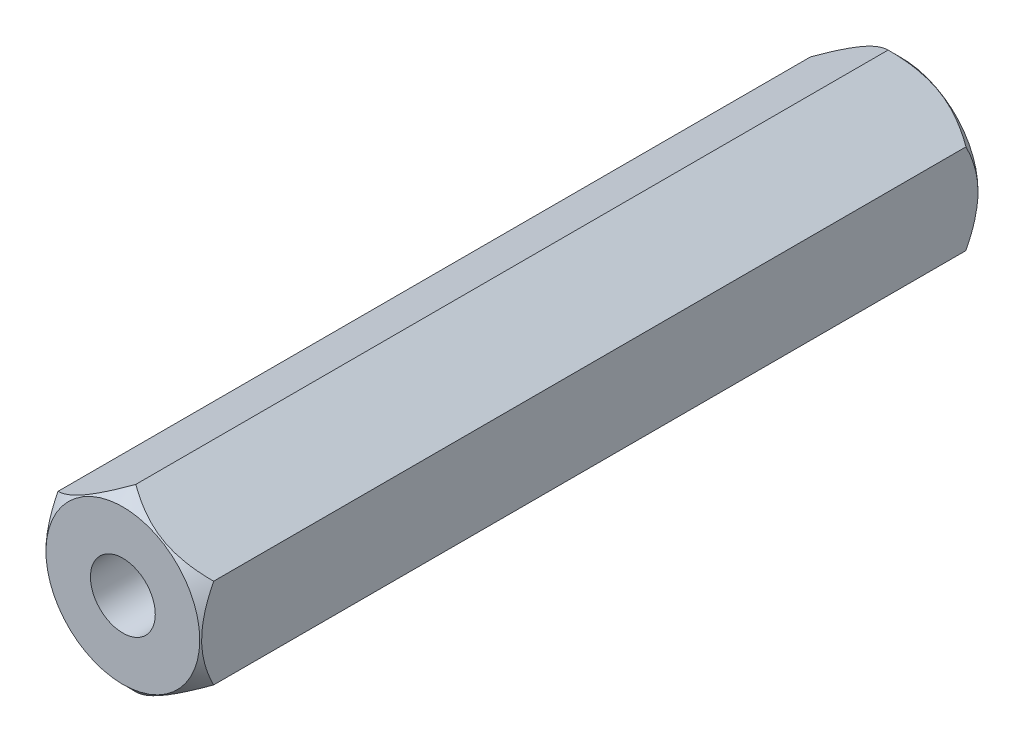
ISO-10303-21;
HEADER;
FILE_DESCRIPTION(('STEP AP214'),'2;1');
FILE_NAME('part.step','',(''),(''),'','','');
FILE_SCHEMA(('AUTOMOTIVE_DESIGN { 1 0 10303 214 1 1 1 1 }'));
ENDSEC;
DATA;
#1=APPLICATION_CONTEXT('core data for automotive mechanical design processes');
#2=APPLICATION_PROTOCOL_DEFINITION('international standard','automotive_design',2000,#1);
#3=PRODUCT_CONTEXT('',#1,'mechanical');
#4=PRODUCT('Part','Part','',(#3));
#5=PRODUCT_RELATED_PRODUCT_CATEGORY('part','',(#4));
#6=PRODUCT_DEFINITION_FORMATION('','',#4);
#7=PRODUCT_DEFINITION_CONTEXT('part definition',#1,'design');
#8=PRODUCT_DEFINITION('design','',#6,#7);
#9=PRODUCT_DEFINITION_SHAPE('','',#8);
#10=(LENGTH_UNIT() NAMED_UNIT(*) SI_UNIT(.MILLI.,.METRE.));
#11=(NAMED_UNIT(*) PLANE_ANGLE_UNIT() SI_UNIT($,.RADIAN.));
#12=(NAMED_UNIT(*) SI_UNIT($,.STERADIAN.) SOLID_ANGLE_UNIT());
#13=UNCERTAINTY_MEASURE_WITH_UNIT(LENGTH_MEASURE(1.E-05),#10,'distance_accuracy_value','');
#14=(GEOMETRIC_REPRESENTATION_CONTEXT(3) GLOBAL_UNCERTAINTY_ASSIGNED_CONTEXT((#13)) GLOBAL_UNIT_ASSIGNED_CONTEXT((#10,
#11,#12)) REPRESENTATION_CONTEXT('',''));
#15=CARTESIAN_POINT('',(0.,0.,0.));
#16=DIRECTION('',(0.,0.,1.));
#17=DIRECTION('',(1.,0.,0.));
#18=AXIS2_PLACEMENT_3D('',#15,#16,#17);
#19=CARTESIAN_POINT('',(2.99999999999998,1.73205080756891,15.));
#20=DIRECTION('',(-0.499999999999995,-0.866025403784441,0.));
#21=DIRECTION('',(0.866025403784442,-0.499999999999995,0.));
#22=AXIS2_PLACEMENT_3D('',#19,#20,#21);
#23=PLANE('',#22);
#24=CARTESIAN_POINT('',(3.00019999999998,1.73193533751508,14.4998845241729));
#25=CARTESIAN_POINT('',(2.89707648504423,1.79147372663456,14.5593716816782));
#26=CARTESIAN_POINT('',(2.79222861066933,1.85200767512887,14.6153650205345));
#27=CARTESIAN_POINT('',(2.57843232821888,1.97544301635337,14.7178874036211));
#28=CARTESIAN_POINT('',(2.46946358862022,2.03835614749391,14.7643594062587));
#29=CARTESIAN_POINT('',(2.24973336040295,2.16521745390425,14.8439668114837));
#30=CARTESIAN_POINT('',(2.13902782823776,2.2291333227006,14.8773022993573));
#31=CARTESIAN_POINT('',(1.91517958943465,2.3583721636312,14.9286624560207));
#32=CARTESIAN_POINT('',(1.80204372079298,2.42369118784647,14.9467254624644));
#33=CARTESIAN_POINT('',(1.60705904380727,2.53626564359202,14.9630230915495));
#34=CARTESIAN_POINT('',(1.52546204599784,2.58337569224236,14.9654356328262));
#35=CARTESIAN_POINT('',(1.36240077116988,2.67751916315868,14.9613705653429));
#36=CARTESIAN_POINT('',(1.28093655070098,2.72455255277573,14.9548898399717));
#37=CARTESIAN_POINT('',(1.11877988766159,2.81817374583241,14.9334082774848));
#38=CARTESIAN_POINT('',(1.03808841121566,2.86476099147977,14.9183979100327));
#39=CARTESIAN_POINT('',(0.87809130210862,2.95713536549228,14.880676353934));
#40=CARTESIAN_POINT('',(0.798785563690657,3.00292255491618,14.8579657556771));
#41=CARTESIAN_POINT('',(0.657993859197203,3.08420868340514,14.811239315146));
#42=CARTESIAN_POINT('',(0.596196277853935,3.11988753362894,14.7884516723192));
#43=CARTESIAN_POINT('',(0.473710582479749,3.1906046828251,14.7392037139425));
#44=CARTESIAN_POINT('',(0.41302250236437,3.22564296221632,14.7127432863338));
#45=CARTESIAN_POINT('',(0.292947002609118,3.29496858432309,14.6567430056086));
#46=CARTESIAN_POINT('',(0.233556167704067,3.32925789884292,14.6272128355216));
#47=CARTESIAN_POINT('',(0.115874438532723,3.39720147685869,14.5654609084245));
#48=CARTESIAN_POINT('',(0.0575828957522616,3.43085611477447,14.5332408033406));
#49=CARTESIAN_POINT('',(-0.000200000000000063,3.46421708519159,14.4998845241729));
#50=B_SPLINE_CURVE_WITH_KNOTS('',3,(#24,#25,#26,#27,#28,#29,#30,#31,#32,#33,#34,#35,#36,#37,#38,
#39,#40,#41,#42,#43,#44,#45,#46,#47,#48,#49),.UNSPECIFIED.,.F.,.F.,(4,2,2,2,2,2,2,2,2,2,2,2,4),
(0.,0.399603557139306,0.801535286397845,1.19708369162343,1.59163620080173,1.87398941755845,
2.15644160919094,2.43921001247427,2.7219567403214,2.94657516661927,3.17120044767273,
3.39513752837807,3.61893808380735),.UNSPECIFIED.);
#51=CARTESIAN_POINT('',(2.99999999999998,1.73205080756891,14.5));
#52=VERTEX_POINT('',#51);
#53=CARTESIAN_POINT('',(0.,3.46410161513776,14.5));
#54=VERTEX_POINT('',#53);
#55=EDGE_CURVE('E85',#52,#54,#50,.T.);
#56=ORIENTED_EDGE('',*,*,#55,.F.);
#57=DIRECTION('',(0.,0.,-1.));
#58=VECTOR('',#57,1.);
#59=CARTESIAN_POINT('',(2.99999999999998,1.73205080756891,15.));
#60=LINE('',#59,#58);
#61=CARTESIAN_POINT('',(2.99999999999998,1.73205080756891,-14.5));
#62=VERTEX_POINT('',#61);
#63=EDGE_CURVE('E55',#52,#62,#60,.T.);
#64=ORIENTED_EDGE('',*,*,#63,.T.);
#65=CARTESIAN_POINT('',(-0.0002,3.46421708519159,-14.4998845241729));
#66=CARTESIAN_POINT('',(0.102923514955747,3.40467869607211,-14.5593716816782));
#67=CARTESIAN_POINT('',(0.207771389330649,3.34414474757781,-14.6153650205345));
#68=CARTESIAN_POINT('',(0.421567671781093,3.2207094063533,-14.7178874036211));
#69=CARTESIAN_POINT('',(0.530536411379756,3.15779627521276,-14.7643594062587));
#70=CARTESIAN_POINT('',(0.750266639597023,3.03093496880243,-14.8439668114837));
#71=CARTESIAN_POINT('',(0.860972171762205,2.96701910000608,-14.8773022993573));
#72=CARTESIAN_POINT('',(1.08482041056532,2.83778025907548,-14.9286624560207));
#73=CARTESIAN_POINT('',(1.19795627920698,2.77246123486021,-14.9467254624644));
#74=CARTESIAN_POINT('',(1.39294095619269,2.65988677911466,-14.9630230915495));
#75=CARTESIAN_POINT('',(1.47453795400212,2.61277673046432,-14.9654356328262));
#76=CARTESIAN_POINT('',(1.63759922883008,2.518633259548,-14.9613705653429));
#77=CARTESIAN_POINT('',(1.71906344929898,2.47159986993096,-14.9548898399717));
#78=CARTESIAN_POINT('',(1.88122011233836,2.37797867687428,-14.9334082774848));
#79=CARTESIAN_POINT('',(1.96191158878429,2.33139143122691,-14.9183979100327));
#80=CARTESIAN_POINT('',(2.12190869789133,2.23901705721441,-14.880676353934));
#81=CARTESIAN_POINT('',(2.20121443630929,2.19322986779052,-14.8579657556772));
#82=CARTESIAN_POINT('',(2.34200614080274,2.11194373930155,-14.8112393151461));
#83=CARTESIAN_POINT('',(2.40380372214602,2.07626488907775,-14.7884516723192));
#84=CARTESIAN_POINT('',(2.52628941752021,2.00554773988158,-14.7392037139426));
#85=CARTESIAN_POINT('',(2.58697749763559,1.97050946049036,-14.7127432863338));
#86=CARTESIAN_POINT('',(2.70705299739085,1.90118383838359,-14.6567430056086));
#87=CARTESIAN_POINT('',(2.7664438322959,1.86689452386376,-14.6272128355216));
#88=CARTESIAN_POINT('',(2.88412556146725,1.79895094584798,-14.5654609084245));
#89=CARTESIAN_POINT('',(2.94241710424772,1.7652963079322,-14.5332408033406));
#90=CARTESIAN_POINT('',(3.00019999999998,1.73193533751508,-14.4998845241729));
#91=B_SPLINE_CURVE_WITH_KNOTS('',3,(#65,#66,#67,#68,#69,#70,#71,#72,#73,#74,#75,#76,#77,#78,#79,
#80,#81,#82,#83,#84,#85,#86,#87,#88,#89,#90),.UNSPECIFIED.,.F.,.F.,(4,2,2,2,2,2,2,2,2,2,2,2,4),
(0.,0.399603557139302,0.801535286397835,1.19708369162341,1.59163620080171,1.87398941755842,
2.15644160919091,2.43921001247423,2.72195674032136,2.94657516661924,3.17120044767272,
3.39513752837807,3.61893808380735),.UNSPECIFIED.);
#92=CARTESIAN_POINT('',(0.,3.46410161513776,-14.5));
#93=VERTEX_POINT('',#92);
#94=EDGE_CURVE('E100',#93,#62,#91,.T.);
#95=ORIENTED_EDGE('',*,*,#94,.F.);
#96=DIRECTION('',(0.,0.,-1.));
#97=VECTOR('',#96,1.);
#98=CARTESIAN_POINT('',(0.,3.46410161513776,15.));
#99=LINE('',#98,#97);
#100=EDGE_CURVE('E11',#54,#93,#99,.T.);
#101=ORIENTED_EDGE('',*,*,#100,.F.);
#102=EDGE_LOOP('',(#56,#64,#95,#101));
#103=FACE_BOUND('',#102,.T.);
#104=ADVANCED_FACE('F32',(#103),#23,.F.);
#105=CARTESIAN_POINT('',(0.,3.46410161513776,15.));
#106=DIRECTION('',(0.500000000000001,-0.866025403784438,0.));
#107=DIRECTION('',(0.866025403784438,0.500000000000001,0.));
#108=AXIS2_PLACEMENT_3D('',#105,#106,#107);
#109=PLANE('',#108);
#110=CARTESIAN_POINT('',(0.000200000000000247,3.46421708519159,14.4998845241729));
#111=CARTESIAN_POINT('',(-0.102923514955749,3.40467869607211,14.5593716816782));
#112=CARTESIAN_POINT('',(-0.207771389330652,3.3441447475778,14.6153650205345));
#113=CARTESIAN_POINT('',(-0.421567671781101,3.22070940635329,14.7178874036211));
#114=CARTESIAN_POINT('',(-0.530536411379767,3.15779627521275,14.7643594062587));
#115=CARTESIAN_POINT('',(-0.750266639597039,3.03093496880241,14.8439668114837));
#116=CARTESIAN_POINT('',(-0.860972171762223,2.96701910000606,14.8773022993573));
#117=CARTESIAN_POINT('',(-1.08482041056534,2.83778025907546,14.9286624560207));
#118=CARTESIAN_POINT('',(-1.19795627920701,2.77246123486019,14.9467254624644));
#119=CARTESIAN_POINT('',(-1.39294095619272,2.65988677911463,14.9630230915495));
#120=CARTESIAN_POINT('',(-1.47453795400215,2.61277673046429,14.9654356328262));
#121=CARTESIAN_POINT('',(-1.63759922883011,2.51863325954797,14.9613705653429));
#122=CARTESIAN_POINT('',(-1.71906344929901,2.47159986993092,14.9548898399717));
#123=CARTESIAN_POINT('',(-1.8812201123384,2.37797867687424,14.9334082774848));
#124=CARTESIAN_POINT('',(-1.96191158878433,2.33139143122688,14.9183979100327));
#125=CARTESIAN_POINT('',(-2.12190869789137,2.23901705721437,14.880676353934));
#126=CARTESIAN_POINT('',(-2.20121443630933,2.19322986779047,14.8579657556772));
#127=CARTESIAN_POINT('',(-2.34200614080278,2.11194373930151,14.811239315146));
#128=CARTESIAN_POINT('',(-2.40380372214605,2.0762648890777,14.7884516723192));
#129=CARTESIAN_POINT('',(-2.52628941752024,2.00554773988154,14.7392037139425));
#130=CARTESIAN_POINT('',(-2.58697749763562,1.97050946049032,14.7127432863338));
#131=CARTESIAN_POINT('',(-2.70705299739088,1.90118383838354,14.6567430056086));
#132=CARTESIAN_POINT('',(-2.76644383229593,1.86689452386372,14.6272128355216));
#133=CARTESIAN_POINT('',(-2.88412556146728,1.79895094584794,14.5654609084245));
#134=CARTESIAN_POINT('',(-2.94241710424774,1.76529630793216,14.5332408033406));
#135=CARTESIAN_POINT('',(-3.00020000000001,1.73193533751503,14.4998845241729));
#136=B_SPLINE_CURVE_WITH_KNOTS('',3,(#110,#111,#112,#113,#114,#115,#116,#117,#118,#119,#120,
#121,#122,#123,#124,#125,#126,#127,#128,#129,#130,#131,#132,#133,#134,#135),.UNSPECIFIED.,.F.,
.F.,(4,2,2,2,2,2,2,2,2,2,2,2,4),(0.,0.399603557139311,0.801535286397855,1.19708369162344,
1.59163620080175,1.87398941755847,2.15644160919096,2.43921001247428,2.72195674032142,
2.9465751666193,3.17120044767277,3.39513752837811,3.6189380838074),.UNSPECIFIED.);
#137=CARTESIAN_POINT('',(-3.00000000000001,1.73205080756887,14.5));
#138=VERTEX_POINT('',#137);
#139=EDGE_CURVE('E93',#54,#138,#136,.T.);
#140=ORIENTED_EDGE('',*,*,#139,.F.);
#141=ORIENTED_EDGE('',*,*,#100,.T.);
#142=CARTESIAN_POINT('',(-3.00020000000001,1.73193533751503,-14.4998845241729));
#143=CARTESIAN_POINT('',(-2.89707648504426,1.79147372663452,-14.5593716816782));
#144=CARTESIAN_POINT('',(-2.79222861066936,1.85200767512883,-14.6153650205345));
#145=CARTESIAN_POINT('',(-2.57843232821891,1.97544301635333,-14.7178874036211));
#146=CARTESIAN_POINT('',(-2.46946358862025,2.03835614749387,-14.7643594062587));
#147=CARTESIAN_POINT('',(-2.24973336040298,2.16521745390421,-14.8439668114837));
#148=CARTESIAN_POINT('',(-2.13902782823779,2.22913332270056,-14.8773022993573));
#149=CARTESIAN_POINT('',(-1.91517958943468,2.35837216363116,-14.9286624560207));
#150=CARTESIAN_POINT('',(-1.80204372079301,2.42369118784643,-14.9467254624644));
#151=CARTESIAN_POINT('',(-1.6070590438073,2.53626564359199,-14.9630230915495));
#152=CARTESIAN_POINT('',(-1.52546204599787,2.58337569224233,-14.9654356328262));
#153=CARTESIAN_POINT('',(-1.36240077116992,2.67751916315865,-14.9613705653429));
#154=CARTESIAN_POINT('',(-1.28093655070102,2.72455255277569,-14.9548898399717));
#155=CARTESIAN_POINT('',(-1.11877988766164,2.81817374583237,-14.9334082774848));
#156=CARTESIAN_POINT('',(-1.03808841121571,2.86476099147974,-14.9183979100327));
#157=CARTESIAN_POINT('',(-0.878091302108673,2.95713536549224,-14.880676353934));
#158=CARTESIAN_POINT('',(-0.798785563690712,3.00292255491614,-14.8579657556772));
#159=CARTESIAN_POINT('',(-0.657993859197255,3.0842086834051,-14.8112393151461));
#160=CARTESIAN_POINT('',(-0.596196277853981,3.11988753362891,-14.7884516723192));
#161=CARTESIAN_POINT('',(-0.473710582479786,3.19060468282508,-14.7392037139426));
#162=CARTESIAN_POINT('',(-0.413022502364402,3.2256429622163,-14.7127432863338));
#163=CARTESIAN_POINT('',(-0.292947002609141,3.29496858432307,-14.6567430056086));
#164=CARTESIAN_POINT('',(-0.233556167704085,3.32925789884291,-14.6272128355216));
#165=CARTESIAN_POINT('',(-0.115874438532732,3.39720147685869,-14.5654609084245));
#166=CARTESIAN_POINT('',(-0.0575828957522661,3.43085611477447,-14.5332408033406));
#167=CARTESIAN_POINT('',(0.000199999999999981,3.46421708519159,-14.4998845241729));
#168=B_SPLINE_CURVE_WITH_KNOTS('',3,(#142,#143,#144,#145,#146,#147,#148,#149,#150,#151,#152,
#153,#154,#155,#156,#157,#158,#159,#160,#161,#162,#163,#164,#165,#166,#167),.UNSPECIFIED.,.F.,
.F.,(4,2,2,2,2,2,2,2,2,2,2,2,4),(0.,0.399603557139307,0.801535286397846,1.19708369162343,
1.59163620080173,1.87398941755844,2.15644160919093,2.43921001247425,2.72195674032138,
2.94657516661927,3.17120044767275,3.39513752837811,3.6189380838074),.UNSPECIFIED.);
#169=CARTESIAN_POINT('',(-3.00000000000001,1.73205080756887,-14.5));
#170=VERTEX_POINT('',#169);
#171=EDGE_CURVE('E104',#170,#93,#168,.T.);
#172=ORIENTED_EDGE('',*,*,#171,.F.);
#173=DIRECTION('',(0.,0.,-1.));
#174=VECTOR('',#173,1.);
#175=CARTESIAN_POINT('',(-3.00000000000001,1.73205080756887,15.));
#176=LINE('',#175,#174);
#177=EDGE_CURVE('E40',#138,#170,#176,.T.);
#178=ORIENTED_EDGE('',*,*,#177,.F.);
#179=EDGE_LOOP('',(#140,#141,#172,#178));
#180=FACE_BOUND('',#179,.T.);
#181=ADVANCED_FACE('F133',(#180),#109,.F.);
#182=CARTESIAN_POINT('',(-3.00000000000001,1.73205080756887,15.));
#183=DIRECTION('',(1.,0.,0.));
#184=DIRECTION('',(0.,1.,0.));
#185=AXIS2_PLACEMENT_3D('',#182,#183,#184);
#186=PLANE('',#185);
#187=CARTESIAN_POINT('',(-2.99999999999999,-3.60017220967184,13.2778195131626));
#188=CARTESIAN_POINT('',(-2.99999999999999,-3.51313765104596,13.3446675914289));
#189=CARTESIAN_POINT('',(-2.99999999999999,-3.42563249287245,13.4109126193683));
#190=CARTESIAN_POINT('',(-2.99999999999999,-3.24948921836676,13.5419215469166));
#191=CARTESIAN_POINT('',(-2.99999999999999,-3.16085083752023,13.6066850905043));
#192=CARTESIAN_POINT('',(-2.99999999999999,-2.98160145725482,13.7349169449311));
#193=CARTESIAN_POINT('',(-2.99999999999999,-2.89098051262274,13.7983713994157));
#194=CARTESIAN_POINT('',(-2.99999999999999,-2.70822761313702,13.9230583092626));
#195=CARTESIAN_POINT('',(-2.99999999999999,-2.61609576318253,13.9842909179429));
#196=CARTESIAN_POINT('',(-2.99999999999999,-2.42422306954656,14.1077912376853));
#197=CARTESIAN_POINT('',(-2.99999999999999,-2.32436788808333,14.1698822034749));
#198=CARTESIAN_POINT('',(-2.99999999999999,-2.12231355534729,14.2901903464936));
#199=CARTESIAN_POINT('',(-2.99999999999999,-2.02011401548863,14.3484068751903));
#200=CARTESIAN_POINT('',(-2.99999999999999,-1.81334633897,14.4597248507824));
#201=CARTESIAN_POINT('',(-2.99999999999999,-1.70878635206411,14.512841317048));
#202=CARTESIAN_POINT('',(-2.99999999999999,-1.49671956345561,14.6127691597761));
#203=CARTESIAN_POINT('',(-2.99999999999999,-1.3892141758587,14.6595835002325));
#204=CARTESIAN_POINT('',(-3.,-1.18162451020427,14.7410539482376));
#205=CARTESIAN_POINT('',(-3.,-1.08183332025572,14.7764492520355));
#206=CARTESIAN_POINT('',(-3.,-0.879720922244446,14.839250905853));
#207=CARTESIAN_POINT('',(-3.,-0.777399552418952,14.8666567436397));
#208=CARTESIAN_POINT('',(-3.,-0.572612584452616,14.9115441590153));
#209=CARTESIAN_POINT('',(-3.,-0.470186961346727,14.9292050562223));
#210=CARTESIAN_POINT('',(-3.,-0.264078945488506,14.9542362750333));
#211=CARTESIAN_POINT('',(-3.,-0.160396813561161,14.9616086966165));
#212=CARTESIAN_POINT('',(-3.,0.0427096176213919,14.9654420851551));
#213=CARTESIAN_POINT('',(-3.,0.142125414358262,14.9623583505179));
#214=CARTESIAN_POINT('',(-3.,0.340174705596965,14.9464916416953));
#215=CARTESIAN_POINT('',(-3.,0.438808127729188,14.9337077805808));
#216=CARTESIAN_POINT('',(-3.,0.63624994970367,14.8989440803276));
#217=CARTESIAN_POINT('',(-3.,0.735029372915854,14.876802418897));
#218=CARTESIAN_POINT('',(-3.,0.930415217780143,14.8245472174801));
#219=CARTESIAN_POINT('',(-3.,1.02702176788805,14.7944341500981));
#220=CARTESIAN_POINT('',(-3.,1.2236758633484,14.7255236452003));
#221=CARTESIAN_POINT('',(-3.,1.32357580295862,14.6863096975049));
#222=CARTESIAN_POINT('',(-3.,1.52079115833372,14.6018315295272));
#223=CARTESIAN_POINT('',(-3.00000000000001,1.61810572975018,14.5565653610887));
#224=CARTESIAN_POINT('',(-3.00000000000001,1.81063206524839,14.4610486908598));
#225=CARTESIAN_POINT('',(-3.00000000000001,1.9058359585856,14.410782453134));
#226=CARTESIAN_POINT('',(-3.00000000000001,2.09405942839048,14.3063762546385));
#227=CARTESIAN_POINT('',(-3.00000000000001,2.1870793859314,14.2522369764459));
#228=CARTESIAN_POINT('',(-3.00000000000001,2.36667514656201,14.1435916608642));
#229=CARTESIAN_POINT('',(-3.00000000000001,2.453342301347,14.089235834379));
#230=CARTESIAN_POINT('',(-3.00000000000001,2.6251876735461,13.9782125526764));
#231=CARTESIAN_POINT('',(-3.00000000000001,2.71036577854073,13.9215449239914));
#232=CARTESIAN_POINT('',(-3.00000000000001,2.87874255832936,13.8067722175246));
#233=CARTESIAN_POINT('',(-3.00000000000001,2.96195163950933,13.7486823515131));
#234=CARTESIAN_POINT('',(-3.00000000000001,3.12722859541802,13.6309469679733));
#235=CARTESIAN_POINT('',(-3.00000000000001,3.20929677837715,13.5713018836442));
#236=CARTESIAN_POINT('',(-3.00000000000001,3.29088643476904,13.5110202632482));
#237=B_SPLINE_CURVE_WITH_KNOTS('',3,(#187,#188,#189,#190,#191,#192,#193,#194,#195,#196,#197,
#198,#199,#200,#201,#202,#203,#204,#205,#206,#207,#208,#209,#210,#211,#212,#213,#214,#215,#216,
#217,#218,#219,#220,#221,#222,#223,#224,#225,#226,#227,#228,#229,#230,#231,#232,#233,#234,#235,
#236),.UNSPECIFIED.,.F.,.F.,(4,2,2,2,2,2,2,2,2,2,2,2,2,2,2,2,2,2,2,2,2,2,2,2,4),(0.,
0.329237185389701,0.658552677025003,0.990410104597518,1.32224458870014,1.67493114147262,
2.02767658187214,2.37934911783584,2.73085567419849,3.04822903781338,3.36562274488828,
3.6769626630627,3.9882390243943,4.28613845351066,4.58406512428139,4.88736936813562,
5.190655633883,5.51237069563638,5.83418956505938,6.15705537344392,6.47986442011631,
6.78672818696386,7.09361502205704,7.39803558554752,7.70237224125957),.UNSPECIFIED.);
#238=CARTESIAN_POINT('',(-2.99999999999999,-1.73205080756889,14.5));
#239=VERTEX_POINT('',#238);
#240=EDGE_CURVE('E122',#138,#239,#237,.F.);
#241=ORIENTED_EDGE('',*,*,#240,.F.);
#242=ORIENTED_EDGE('',*,*,#177,.T.);
#243=CARTESIAN_POINT('',(-2.99999999999999,-3.60017220967182,-13.2778195131625));
#244=CARTESIAN_POINT('',(-2.99999999999999,-3.51313765104594,-13.3446675914289));
#245=CARTESIAN_POINT('',(-2.99999999999999,-3.42563249287243,-13.4109126193683));
#246=CARTESIAN_POINT('',(-2.99999999999999,-3.24948921836674,-13.5419215469166));
#247=CARTESIAN_POINT('',(-2.99999999999999,-3.16085083752022,-13.6066850905043));
#248=CARTESIAN_POINT('',(-2.99999999999999,-2.98160145725481,-13.7349169449311));
#249=CARTESIAN_POINT('',(-2.99999999999999,-2.89098051262273,-13.7983713994157));
#250=CARTESIAN_POINT('',(-2.99999999999999,-2.70822761313701,-13.9230583092626));
#251=CARTESIAN_POINT('',(-2.99999999999999,-2.61609576318252,-13.9842909179429));
#252=CARTESIAN_POINT('',(-2.99999999999999,-2.42422306954656,-14.1077912376853));
#253=CARTESIAN_POINT('',(-2.99999999999999,-2.32436788808332,-14.1698822034749));
#254=CARTESIAN_POINT('',(-2.99999999999999,-2.12231355534729,-14.2901903464936));
#255=CARTESIAN_POINT('',(-2.99999999999999,-2.02011401548863,-14.3484068751903));
#256=CARTESIAN_POINT('',(-2.99999999999999,-1.81334633897,-14.4597248507824));
#257=CARTESIAN_POINT('',(-2.99999999999999,-1.70878635206411,-14.512841317048));
#258=CARTESIAN_POINT('',(-2.99999999999999,-1.49671956345561,-14.6127691597761));
#259=CARTESIAN_POINT('',(-2.99999999999999,-1.3892141758587,-14.6595835002325));
#260=CARTESIAN_POINT('',(-3.,-1.18162451020427,-14.7410539482376));
#261=CARTESIAN_POINT('',(-3.,-1.08183332025572,-14.7764492520355));
#262=CARTESIAN_POINT('',(-3.,-0.879720922244454,-14.839250905853));
#263=CARTESIAN_POINT('',(-3.,-0.777399552418961,-14.8666567436397));
#264=CARTESIAN_POINT('',(-3.,-0.572612584452628,-14.9115441590153));
#265=CARTESIAN_POINT('',(-3.,-0.470186961346741,-14.9292050562223));
#266=CARTESIAN_POINT('',(-3.,-0.264078945488523,-14.9542362750334));
#267=CARTESIAN_POINT('',(-3.,-0.160396813561179,-14.9616086966165));
#268=CARTESIAN_POINT('',(-3.,0.0427096176213708,-14.9654420851551));
#269=CARTESIAN_POINT('',(-3.,0.14212541435824,-14.9623583505179));
#270=CARTESIAN_POINT('',(-3.,0.34017470559694,-14.9464916416953));
#271=CARTESIAN_POINT('',(-3.,0.438808127729162,-14.9337077805808));
#272=CARTESIAN_POINT('',(-3.,0.636249949703642,-14.8989440803276));
#273=CARTESIAN_POINT('',(-3.,0.735029372915826,-14.876802418897));
#274=CARTESIAN_POINT('',(-3.,0.930415217780112,-14.8245472174801));
#275=CARTESIAN_POINT('',(-3.,1.02702176788802,-14.7944341500982));
#276=CARTESIAN_POINT('',(-3.,1.22367586334836,-14.7255236452003));
#277=CARTESIAN_POINT('',(-3.,1.32357580295858,-14.6863096975049));
#278=CARTESIAN_POINT('',(-3.,1.52079115833368,-14.6018315295273));
#279=CARTESIAN_POINT('',(-3.00000000000001,1.61810572975013,-14.5565653610888));
#280=CARTESIAN_POINT('',(-3.00000000000001,1.81063206524833,-14.4610486908599));
#281=CARTESIAN_POINT('',(-3.00000000000001,1.90583595858554,-14.410782453134));
#282=CARTESIAN_POINT('',(-3.00000000000001,2.09405942839041,-14.3063762546385));
#283=CARTESIAN_POINT('',(-3.00000000000001,2.18707938593132,-14.252236976446));
#284=CARTESIAN_POINT('',(-3.00000000000001,2.36667514656192,-14.1435916608643));
#285=CARTESIAN_POINT('',(-3.00000000000001,2.45334230134691,-14.089235834379));
#286=CARTESIAN_POINT('',(-3.00000000000001,2.625187673546,-13.9782125526765));
#287=CARTESIAN_POINT('',(-3.00000000000001,2.71036577854063,-13.9215449239914));
#288=CARTESIAN_POINT('',(-3.00000000000001,2.87874255832925,-13.8067722175247));
#289=CARTESIAN_POINT('',(-3.00000000000001,2.96195163950922,-13.7486823515132));
#290=CARTESIAN_POINT('',(-3.00000000000001,3.1272285954179,-13.6309469679734));
#291=CARTESIAN_POINT('',(-3.00000000000001,3.20929677837702,-13.5713018836443));
#292=CARTESIAN_POINT('',(-3.00000000000001,3.29088643476891,-13.5110202632483));
#293=B_SPLINE_CURVE_WITH_KNOTS('',3,(#243,#244,#245,#246,#247,#248,#249,#250,#251,#252,#253,
#254,#255,#256,#257,#258,#259,#260,#261,#262,#263,#264,#265,#266,#267,#268,#269,#270,#271,#272,
#273,#274,#275,#276,#277,#278,#279,#280,#281,#282,#283,#284,#285,#286,#287,#288,#289,#290,#291,
#292),.UNSPECIFIED.,.F.,.F.,(4,2,2,2,2,2,2,2,2,2,2,2,2,2,2,2,2,2,2,2,2,2,2,2,4),(0.,
0.329237185389698,0.658552677025,0.990410104597515,1.32224458870014,1.67493114147261,
2.02767658187213,2.37934911783583,2.73085567419847,3.04822903781336,3.36562274488826,
3.67696266306267,3.98823902439427,4.28613845351063,4.58406512428135,4.88736936813558,
5.19065563388295,5.51237069563632,5.83418956505931,6.15705537344383,6.47986442011621,
6.78672818696375,7.09361502205691,7.39803558554738,7.70237224125941),.UNSPECIFIED.);
#294=CARTESIAN_POINT('',(-2.99999999999999,-1.73205080756889,-14.5));
#295=VERTEX_POINT('',#294);
#296=EDGE_CURVE('E121',#295,#170,#293,.T.);
#297=ORIENTED_EDGE('',*,*,#296,.F.);
#298=DIRECTION('',(0.,0.,-1.));
#299=VECTOR('',#298,1.);
#300=CARTESIAN_POINT('',(-2.99999999999999,-1.73205080756889,15.));
#301=LINE('',#300,#299);
#302=EDGE_CURVE('E113',#239,#295,#301,.T.);
#303=ORIENTED_EDGE('',*,*,#302,.F.);
#304=EDGE_LOOP('',(#241,#242,#297,#303));
#305=FACE_BOUND('',#304,.T.);
#306=ADVANCED_FACE('F119',(#305),#186,.F.);
#307=CARTESIAN_POINT('',(-2.99999999999999,-1.73205080756889,15.));
#308=DIRECTION('',(0.499999999999995,0.866025403784442,0.));
#309=DIRECTION('',(-0.866025403784442,0.499999999999995,0.));
#310=AXIS2_PLACEMENT_3D('',#307,#308,#309);
#311=PLANE('',#310);
#312=CARTESIAN_POINT('',(-3.00019999999999,-1.73193533751505,14.4998845241729));
#313=CARTESIAN_POINT('',(-2.89707648504424,-1.79147372663454,14.5593716816782));
#314=CARTESIAN_POINT('',(-2.79222861066934,-1.85200767512885,14.6153650205345));
#315=CARTESIAN_POINT('',(-2.57843232821889,-1.97544301635335,14.7178874036211));
#316=CARTESIAN_POINT('',(-2.46946358862022,-2.0383561474939,14.7643594062587));
#317=CARTESIAN_POINT('',(-2.24973336040295,-2.16521745390423,14.8439668114837));
#318=CARTESIAN_POINT('',(-2.13902782823777,-2.22913332270058,14.8773022993573));
#319=CARTESIAN_POINT('',(-1.91517958943465,-2.35837216363119,14.9286624560207));
#320=CARTESIAN_POINT('',(-1.80204372079298,-2.42369118784645,14.9467254624644));
#321=CARTESIAN_POINT('',(-1.60705904380727,-2.53626564359201,14.9630230915495));
#322=CARTESIAN_POINT('',(-1.52546204599783,-2.58337569224235,14.9654356328262));
#323=CARTESIAN_POINT('',(-1.36240077116988,-2.67751916315867,14.9613705653429));
#324=CARTESIAN_POINT('',(-1.28093655070097,-2.72455255277571,14.9548898399717));
#325=CARTESIAN_POINT('',(-1.11877988766159,-2.81817374583239,14.9334082774848));
#326=CARTESIAN_POINT('',(-1.03808841121566,-2.86476099147976,14.9183979100327));
#327=CARTESIAN_POINT('',(-0.878091302108619,-2.95713536549227,14.880676353934));
#328=CARTESIAN_POINT('',(-0.798785563690657,-3.00292255491616,14.8579657556772));
#329=CARTESIAN_POINT('',(-0.6579938591972,-3.08420868340512,14.811239315146));
#330=CARTESIAN_POINT('',(-0.59619627785393,-3.11988753362893,14.7884516723192));
#331=CARTESIAN_POINT('',(-0.47371058247974,-3.19060468282509,14.7392037139425));
#332=CARTESIAN_POINT('',(-0.413022502364359,-3.22564296221631,14.7127432863338));
#333=CARTESIAN_POINT('',(-0.292947002609104,-3.29496858432309,14.6567430056086));
#334=CARTESIAN_POINT('',(-0.233556167704051,-3.32925789884291,14.6272128355216));
#335=CARTESIAN_POINT('',(-0.115874438532704,-3.39720147685869,14.5654609084245));
#336=CARTESIAN_POINT('',(-0.0575828957522401,-3.43085611477447,14.5332408033406));
#337=CARTESIAN_POINT('',(0.000200000000024296,-3.46421708519159,14.4998845241729));
#338=B_SPLINE_CURVE_WITH_KNOTS('',3,(#312,#313,#314,#315,#316,#317,#318,#319,#320,#321,#322,
#323,#324,#325,#326,#327,#328,#329,#330,#331,#332,#333,#334,#335,#336,#337),.UNSPECIFIED.,.F.,
.F.,(4,2,2,2,2,2,2,2,2,2,2,2,4),(0.,0.39960355713931,0.801535286397854,1.19708369162344,
1.59163620080175,1.87398941755847,2.15644160919096,2.43921001247428,2.72195674032142,
2.9465751666193,3.17120044767276,3.39513752837811,3.61893808380739),.UNSPECIFIED.);
#339=CARTESIAN_POINT('',(0.,-3.46410161513776,14.5));
#340=VERTEX_POINT('',#339);
#341=EDGE_CURVE('E183',#239,#340,#338,.T.);
#342=ORIENTED_EDGE('',*,*,#341,.F.);
#343=ORIENTED_EDGE('',*,*,#302,.T.);
#344=CARTESIAN_POINT('',(0.00020000000002419,-3.4642170851916,-14.4998845241729));
#345=CARTESIAN_POINT('',(-0.102923514955724,-3.40467869607211,-14.5593716816782));
#346=CARTESIAN_POINT('',(-0.207771389330627,-3.3441447475778,-14.6153650205345));
#347=CARTESIAN_POINT('',(-0.421567671781074,-3.2207094063533,-14.7178874036211));
#348=CARTESIAN_POINT('',(-0.530536411379738,-3.15779627521276,-14.7643594062587));
#349=CARTESIAN_POINT('',(-0.750266639597008,-3.03093496880242,-14.8439668114837));
#350=CARTESIAN_POINT('',(-0.860972171762192,-2.96701910000607,-14.8773022993573));
#351=CARTESIAN_POINT('',(-1.08482041056531,-2.83778025907547,-14.9286624560207));
#352=CARTESIAN_POINT('',(-1.19795627920697,-2.7724612348602,-14.9467254624644));
#353=CARTESIAN_POINT('',(-1.39294095619268,-2.65988677911465,-14.9630230915495));
#354=CARTESIAN_POINT('',(-1.47453795400212,-2.61277673046431,-14.9654356328262));
#355=CARTESIAN_POINT('',(-1.63759922883007,-2.51863325954799,-14.9613705653429));
#356=CARTESIAN_POINT('',(-1.71906344929897,-2.47159986993095,-14.9548898399717));
#357=CARTESIAN_POINT('',(-1.88122011233835,-2.37797867687427,-14.9334082774848));
#358=CARTESIAN_POINT('',(-1.96191158878428,-2.33139143122691,-14.9183979100327));
#359=CARTESIAN_POINT('',(-2.12190869789132,-2.2390170572144,-14.880676353934));
#360=CARTESIAN_POINT('',(-2.20121443630928,-2.19322986779051,-14.8579657556772));
#361=CARTESIAN_POINT('',(-2.34200614080274,-2.11194373930154,-14.8112393151461));
#362=CARTESIAN_POINT('',(-2.40380372214601,-2.07626488907774,-14.7884516723192));
#363=CARTESIAN_POINT('',(-2.52628941752021,-2.00554773988157,-14.7392037139426));
#364=CARTESIAN_POINT('',(-2.58697749763559,-1.97050946049035,-14.7127432863338));
#365=CARTESIAN_POINT('',(-2.70705299739085,-1.90118383838357,-14.6567430056086));
#366=CARTESIAN_POINT('',(-2.76644383229591,-1.86689452386374,-14.6272128355216));
#367=CARTESIAN_POINT('',(-2.88412556146726,-1.79895094584796,-14.5654609084245));
#368=CARTESIAN_POINT('',(-2.94241710424773,-1.76529630793218,-14.5332408033406));
#369=CARTESIAN_POINT('',(-3.00019999999999,-1.73193533751505,-14.4998845241729));
#370=B_SPLINE_CURVE_WITH_KNOTS('',3,(#344,#345,#346,#347,#348,#349,#350,#351,#352,#353,#354,
#355,#356,#357,#358,#359,#360,#361,#362,#363,#364,#365,#366,#367,#368,#369),.UNSPECIFIED.,.F.,
.F.,(4,2,2,2,2,2,2,2,2,2,2,2,4),(0.,0.399603557139308,0.801535286397847,1.19708369162343,
1.59163620080173,1.87398941755844,2.15644160919093,2.43921001247425,2.72195674032138,
2.94657516661927,3.17120044767275,3.39513752837811,3.6189380838074),.UNSPECIFIED.);
#371=CARTESIAN_POINT('',(0.,-3.46410161513776,-14.5));
#372=VERTEX_POINT('',#371);
#373=EDGE_CURVE('E131',#372,#295,#370,.T.);
#374=ORIENTED_EDGE('',*,*,#373,.F.);
#375=DIRECTION('',(0.,0.,-1.));
#376=VECTOR('',#375,1.);
#377=CARTESIAN_POINT('',(0.,-3.46410161513776,15.));
#378=LINE('',#377,#376);
#379=EDGE_CURVE('E102',#340,#372,#378,.T.);
#380=ORIENTED_EDGE('',*,*,#379,.F.);
#381=EDGE_LOOP('',(#342,#343,#374,#380));
#382=FACE_BOUND('',#381,.T.);
#383=ADVANCED_FACE('F174',(#382),#311,.F.);
#384=CARTESIAN_POINT('',(0.,-3.46410161513776,15.));
#385=DIRECTION('',(-0.500000000000007,0.866025403784435,0.));
#386=DIRECTION('',(-0.866025403784435,-0.500000000000007,0.));
#387=AXIS2_PLACEMENT_3D('',#384,#385,#386);
#388=PLANE('',#387);
#389=CARTESIAN_POINT('',(-0.000199999999976056,-3.46421708519159,14.4998845241729));
#390=CARTESIAN_POINT('',(0.102923514955773,-3.40467869607211,14.5593716816782));
#391=CARTESIAN_POINT('',(0.207771389330676,-3.3441447475778,14.6153650205345));
#392=CARTESIAN_POINT('',(0.421567671781124,-3.22070940635329,14.7178874036211));
#393=CARTESIAN_POINT('',(0.530536411379789,-3.15779627521275,14.7643594062587));
#394=CARTESIAN_POINT('',(0.75026663959706,-3.0309349688024,14.8439668114837));
#395=CARTESIAN_POINT('',(0.860972171762244,-2.96701910000605,14.8773022993573));
#396=CARTESIAN_POINT('',(1.08482041056536,-2.83778025907545,14.9286624560207));
#397=CARTESIAN_POINT('',(1.19795627920703,-2.77246123486018,14.9467254624644));
#398=CARTESIAN_POINT('',(1.39294095619274,-2.65988677911462,14.9630230915495));
#399=CARTESIAN_POINT('',(1.47453795400217,-2.61277673046428,14.9654356328262));
#400=CARTESIAN_POINT('',(1.63759922883013,-2.51863325954795,14.9613705653429));
#401=CARTESIAN_POINT('',(1.71906344929903,-2.47159986993091,14.9548898399717));
#402=CARTESIAN_POINT('',(1.88122011233841,-2.37797867687423,14.9334082774848));
#403=CARTESIAN_POINT('',(1.96191158878435,-2.33139143122686,14.9183979100327));
#404=CARTESIAN_POINT('',(2.12190869789138,-2.23901705721435,14.880676353934));
#405=CARTESIAN_POINT('',(2.20121443630934,-2.19322986779046,14.8579657556772));
#406=CARTESIAN_POINT('',(2.3420061408028,-2.11194373930149,14.811239315146));
#407=CARTESIAN_POINT('',(2.40380372214607,-2.07626488907769,14.7884516723192));
#408=CARTESIAN_POINT('',(2.52628941752026,-2.00554773988152,14.7392037139425));
#409=CARTESIAN_POINT('',(2.58697749763564,-1.9705094604903,14.7127432863338));
#410=CARTESIAN_POINT('',(2.70705299739089,-1.90118383838353,14.6567430056086));
#411=CARTESIAN_POINT('',(2.76644383229595,-1.8668945238637,14.6272128355216));
#412=CARTESIAN_POINT('',(2.88412556146729,-1.79895094584792,14.5654609084245));
#413=CARTESIAN_POINT('',(2.94241710424775,-1.76529630793214,14.5332408033406));
#414=CARTESIAN_POINT('',(3.00020000000002,-1.73193533751501,14.4998845241729));
#415=B_SPLINE_CURVE_WITH_KNOTS('',3,(#389,#390,#391,#392,#393,#394,#395,#396,#397,#398,#399,
#400,#401,#402,#403,#404,#405,#406,#407,#408,#409,#410,#411,#412,#413,#414),.UNSPECIFIED.,.F.,
.F.,(4,2,2,2,2,2,2,2,2,2,2,2,4),(0.,0.399603557139311,0.801535286397856,1.19708369162344,
1.59163620080175,1.87398941755847,2.15644160919096,2.43921001247428,2.72195674032142,
2.9465751666193,3.17120044767277,3.39513752837811,3.61893808380739),.UNSPECIFIED.);
#416=CARTESIAN_POINT('',(3.00000000000002,-1.73205080756885,14.5));
#417=VERTEX_POINT('',#416);
#418=EDGE_CURVE('E47',#340,#417,#415,.T.);
#419=ORIENTED_EDGE('',*,*,#418,.F.);
#420=ORIENTED_EDGE('',*,*,#379,.T.);
#421=CARTESIAN_POINT('',(3.00020000000002,-1.73193533751501,-14.4998845241729));
#422=CARTESIAN_POINT('',(2.89707648504427,-1.7914737266345,-14.5593716816782));
#423=CARTESIAN_POINT('',(2.79222861066937,-1.85200767512881,-14.6153650205345));
#424=CARTESIAN_POINT('',(2.57843232821892,-1.97544301635331,-14.7178874036211));
#425=CARTESIAN_POINT('',(2.46946358862026,-2.03835614749386,-14.7643594062587));
#426=CARTESIAN_POINT('',(2.24973336040299,-2.1652174539042,-14.8439668114837));
#427=CARTESIAN_POINT('',(2.13902782823781,-2.22913332270055,-14.8773022993573));
#428=CARTESIAN_POINT('',(1.91517958943469,-2.35837216363115,-14.9286624560207));
#429=CARTESIAN_POINT('',(1.80204372079303,-2.42369118784642,-14.9467254624644));
#430=CARTESIAN_POINT('',(1.60705904380732,-2.53626564359198,-14.9630230915495));
#431=CARTESIAN_POINT('',(1.52546204599789,-2.58337569224232,-14.9654356328262));
#432=CARTESIAN_POINT('',(1.36240077116993,-2.67751916315864,-14.9613705653429));
#433=CARTESIAN_POINT('',(1.28093655070104,-2.72455255277568,-14.9548898399717));
#434=CARTESIAN_POINT('',(1.11877988766166,-2.81817374583236,-14.9334082774848));
#435=CARTESIAN_POINT('',(1.03808841121572,-2.86476099147973,-14.9183979100327));
#436=CARTESIAN_POINT('',(0.878091302108692,-2.95713536549224,-14.880676353934));
#437=CARTESIAN_POINT('',(0.798785563690732,-3.00292255491613,-14.8579657556772));
#438=CARTESIAN_POINT('',(0.657993859197275,-3.0842086834051,-14.8112393151461));
#439=CARTESIAN_POINT('',(0.596196277854002,-3.1198875336289,-14.7884516723192));
#440=CARTESIAN_POINT('',(0.473710582479807,-3.19060468282507,-14.7392037139426));
#441=CARTESIAN_POINT('',(0.413022502364423,-3.22564296221629,-14.7127432863338));
#442=CARTESIAN_POINT('',(0.292947002609162,-3.29496858432307,-14.6567430056086));
#443=CARTESIAN_POINT('',(0.233556167704107,-3.3292578988429,-14.6272128355216));
#444=CARTESIAN_POINT('',(0.115874438532755,-3.39720147685869,-14.5654609084245));
#445=CARTESIAN_POINT('',(0.0575828957522897,-3.43085611477447,-14.5332408033406));
#446=CARTESIAN_POINT('',(-0.000199999999976104,-3.46421708519159,-14.4998845241729));
#447=B_SPLINE_CURVE_WITH_KNOTS('',3,(#421,#422,#423,#424,#425,#426,#427,#428,#429,#430,#431,
#432,#433,#434,#435,#436,#437,#438,#439,#440,#441,#442,#443,#444,#445,#446),.UNSPECIFIED.,.F.,
.F.,(4,2,2,2,2,2,2,2,2,2,2,2,4),(0.,0.399603557139308,0.801535286397848,1.19708369162343,
1.59163620080173,1.87398941755845,2.15644160919093,2.43921001247425,2.72195674032138,
2.94657516661927,3.17120044767275,3.39513752837811,3.6189380838074),.UNSPECIFIED.);
#448=CARTESIAN_POINT('',(3.00000000000002,-1.73205080756885,-14.5));
#449=VERTEX_POINT('',#448);
#450=EDGE_CURVE('E164',#449,#372,#447,.T.);
#451=ORIENTED_EDGE('',*,*,#450,.F.);
#452=DIRECTION('',(0.,0.,-1.));
#453=VECTOR('',#452,1.);
#454=CARTESIAN_POINT('',(3.00000000000002,-1.73205080756885,15.));
#455=LINE('',#454,#453);
#456=EDGE_CURVE('E99',#417,#449,#455,.T.);
#457=ORIENTED_EDGE('',*,*,#456,.F.);
#458=EDGE_LOOP('',(#419,#420,#451,#457));
#459=FACE_BOUND('',#458,.T.);
#460=ADVANCED_FACE('F177',(#459),#388,.F.);
#461=CARTESIAN_POINT('',(3.00000000000002,-1.73205080756885,15.));
#462=DIRECTION('',(-1.,0.,0.));
#463=DIRECTION('',(0.,-1.,0.));
#464=AXIS2_PLACEMENT_3D('',#461,#462,#463);
#465=PLANE('',#464);
#466=CARTESIAN_POINT('',(3.00000000000004,-3.6001722096718,13.2778195131626));
#467=CARTESIAN_POINT('',(3.00000000000004,-3.51313765104592,13.3446675914289));
#468=CARTESIAN_POINT('',(3.00000000000004,-3.42563249287241,13.4109126193683));
#469=CARTESIAN_POINT('',(3.00000000000003,-3.24948921836672,13.5419215469166));
#470=CARTESIAN_POINT('',(3.00000000000003,-3.16085083752019,13.6066850905043));
#471=CARTESIAN_POINT('',(3.00000000000003,-2.98160145725478,13.7349169449311));
#472=CARTESIAN_POINT('',(3.00000000000003,-2.8909805126227,13.7983713994157));
#473=CARTESIAN_POINT('',(3.00000000000003,-2.70822761313698,13.9230583092626));
#474=CARTESIAN_POINT('',(3.00000000000003,-2.61609576318249,13.9842909179429));
#475=CARTESIAN_POINT('',(3.00000000000003,-2.42422306954652,14.1077912376853));
#476=CARTESIAN_POINT('',(3.00000000000002,-2.32436788808329,14.1698822034749));
#477=CARTESIAN_POINT('',(3.00000000000002,-2.12231355534725,14.2901903464936));
#478=CARTESIAN_POINT('',(3.00000000000002,-2.02011401548859,14.3484068751903));
#479=CARTESIAN_POINT('',(3.00000000000002,-1.81334633896996,14.4597248507824));
#480=CARTESIAN_POINT('',(3.00000000000002,-1.70878635206407,14.512841317048));
#481=CARTESIAN_POINT('',(3.00000000000002,-1.49671956345557,14.6127691597761));
#482=CARTESIAN_POINT('',(3.00000000000001,-1.38921417585866,14.6595835002325));
#483=CARTESIAN_POINT('',(3.00000000000001,-1.18162451020423,14.7410539482376));
#484=CARTESIAN_POINT('',(3.00000000000001,-1.08183332025568,14.7764492520355));
#485=CARTESIAN_POINT('',(3.00000000000001,-0.879720922244405,14.839250905853));
#486=CARTESIAN_POINT('',(3.00000000000001,-0.777399552418911,14.8666567436397));
#487=CARTESIAN_POINT('',(3.00000000000001,-0.572612584452575,14.9115441590153));
#488=CARTESIAN_POINT('',(3.,-0.470186961346686,14.9292050562223));
#489=CARTESIAN_POINT('',(3.,-0.264078945488465,14.9542362750333));
#490=CARTESIAN_POINT('',(3.,-0.16039681356112,14.9616086966165));
#491=CARTESIAN_POINT('',(3.,0.0427096176214335,14.9654420851551));
#492=CARTESIAN_POINT('',(3.,0.142125414358304,14.9623583505179));
#493=CARTESIAN_POINT('',(3.,0.340174705597006,14.9464916416953));
#494=CARTESIAN_POINT('',(3.,0.438808127729229,14.9337077805808));
#495=CARTESIAN_POINT('',(2.99999999999999,0.636249949703711,14.8989440803276));
#496=CARTESIAN_POINT('',(2.99999999999999,0.735029372915895,14.876802418897));
#497=CARTESIAN_POINT('',(2.99999999999999,0.930415217780184,14.8245472174801));
#498=CARTESIAN_POINT('',(2.99999999999999,1.02702176788809,14.7944341500981));
#499=CARTESIAN_POINT('',(2.99999999999999,1.22367586334844,14.7255236452003));
#500=CARTESIAN_POINT('',(2.99999999999999,1.32357580295867,14.6863096975049));
#501=CARTESIAN_POINT('',(2.99999999999998,1.52079115833377,14.6018315295272));
#502=CARTESIAN_POINT('',(2.99999999999998,1.61810572975022,14.5565653610887));
#503=CARTESIAN_POINT('',(2.99999999999998,1.81063206524844,14.4610486908598));
#504=CARTESIAN_POINT('',(2.99999999999998,1.90583595858565,14.410782453134));
#505=CARTESIAN_POINT('',(2.99999999999998,2.09405942839053,14.3063762546385));
#506=CARTESIAN_POINT('',(2.99999999999998,2.18707938593144,14.2522369764459));
#507=CARTESIAN_POINT('',(2.99999999999998,2.36667514656205,14.1435916608642));
#508=CARTESIAN_POINT('',(2.99999999999997,2.45334230134704,14.089235834379));
#509=CARTESIAN_POINT('',(2.99999999999997,2.62518767354614,13.9782125526764));
#510=CARTESIAN_POINT('',(2.99999999999997,2.71036577854078,13.9215449239914));
#511=CARTESIAN_POINT('',(2.99999999999997,2.8787425583294,13.8067722175246));
#512=CARTESIAN_POINT('',(2.99999999999997,2.96195163950937,13.7486823515131));
#513=CARTESIAN_POINT('',(2.99999999999997,3.12722859541806,13.6309469679733));
#514=CARTESIAN_POINT('',(2.99999999999997,3.20929677837719,13.5713018836442));
#515=CARTESIAN_POINT('',(2.99999999999997,3.29088643476908,13.5110202632482));
#516=B_SPLINE_CURVE_WITH_KNOTS('',3,(#466,#467,#468,#469,#470,#471,#472,#473,#474,#475,#476,
#477,#478,#479,#480,#481,#482,#483,#484,#485,#486,#487,#488,#489,#490,#491,#492,#493,#494,#495,
#496,#497,#498,#499,#500,#501,#502,#503,#504,#505,#506,#507,#508,#509,#510,#511,#512,#513,#514,
#515),.UNSPECIFIED.,.F.,.F.,(4,2,2,2,2,2,2,2,2,2,2,2,2,2,2,2,2,2,2,2,2,2,2,2,4),(0.,
0.329237185389701,0.658552677025004,0.990410104597522,1.32224458870015,1.67493114147262,
2.02767658187214,2.37934911783584,2.73085567419849,3.04822903781338,3.36562274488828,
3.6769626630627,3.98823902439431,4.28613845351067,4.58406512428139,4.88736936813563,
5.190655633883,5.51237069563638,5.83418956505938,6.15705537344392,6.47986442011631,
6.78672818696387,7.09361502205704,7.39803558554752,7.70237224125957),.UNSPECIFIED.);
#517=EDGE_CURVE('E83',#417,#52,#516,.T.);
#518=ORIENTED_EDGE('',*,*,#517,.F.);
#519=ORIENTED_EDGE('',*,*,#456,.T.);
#520=CARTESIAN_POINT('',(3.00000000000004,-3.60017220967177,-13.2778195131625));
#521=CARTESIAN_POINT('',(3.00000000000004,-3.5131376510459,-13.3446675914289));
#522=CARTESIAN_POINT('',(3.00000000000004,-3.42563249287239,-13.4109126193683));
#523=CARTESIAN_POINT('',(3.00000000000003,-3.2494892183667,-13.5419215469166));
#524=CARTESIAN_POINT('',(3.00000000000003,-3.16085083752017,-13.6066850905043));
#525=CARTESIAN_POINT('',(3.00000000000003,-2.98160145725477,-13.7349169449311));
#526=CARTESIAN_POINT('',(3.00000000000003,-2.89098051262269,-13.7983713994157));
#527=CARTESIAN_POINT('',(3.00000000000003,-2.70822761313697,-13.9230583092626));
#528=CARTESIAN_POINT('',(3.00000000000003,-2.61609576318248,-13.9842909179429));
#529=CARTESIAN_POINT('',(3.00000000000003,-2.42422306954652,-14.1077912376853));
#530=CARTESIAN_POINT('',(3.00000000000002,-2.32436788808328,-14.1698822034749));
#531=CARTESIAN_POINT('',(3.00000000000002,-2.12231355534724,-14.2901903464936));
#532=CARTESIAN_POINT('',(3.00000000000002,-2.02011401548859,-14.3484068751903));
#533=CARTESIAN_POINT('',(3.00000000000002,-1.81334633896996,-14.4597248507824));
#534=CARTESIAN_POINT('',(3.00000000000002,-1.70878635206407,-14.512841317048));
#535=CARTESIAN_POINT('',(3.00000000000002,-1.49671956345557,-14.6127691597761));
#536=CARTESIAN_POINT('',(3.00000000000001,-1.38921417585866,-14.6595835002325));
#537=CARTESIAN_POINT('',(3.00000000000001,-1.18162451020423,-14.7410539482376));
#538=CARTESIAN_POINT('',(3.00000000000001,-1.08183332025568,-14.7764492520355));
#539=CARTESIAN_POINT('',(3.00000000000001,-0.879720922244413,-14.839250905853));
#540=CARTESIAN_POINT('',(3.00000000000001,-0.77739955241892,-14.8666567436397));
#541=CARTESIAN_POINT('',(3.00000000000001,-0.572612584452587,-14.9115441590153));
#542=CARTESIAN_POINT('',(3.,-0.470186961346699,-14.9292050562223));
#543=CARTESIAN_POINT('',(3.,-0.264078945488482,-14.9542362750334));
#544=CARTESIAN_POINT('',(3.,-0.160396813561138,-14.9616086966165));
#545=CARTESIAN_POINT('',(3.,0.042709617621412,-14.9654420851551));
#546=CARTESIAN_POINT('',(3.,0.142125414358281,-14.9623583505179));
#547=CARTESIAN_POINT('',(3.,0.340174705596982,-14.9464916416953));
#548=CARTESIAN_POINT('',(3.,0.438808127729204,-14.9337077805808));
#549=CARTESIAN_POINT('',(2.99999999999999,0.636249949703684,-14.8989440803276));
#550=CARTESIAN_POINT('',(2.99999999999999,0.735029372915867,-14.876802418897));
#551=CARTESIAN_POINT('',(2.99999999999999,0.930415217780154,-14.8245472174801));
#552=CARTESIAN_POINT('',(2.99999999999999,1.02702176788806,-14.7944341500982));
#553=CARTESIAN_POINT('',(2.99999999999999,1.2236758633484,-14.7255236452003));
#554=CARTESIAN_POINT('',(2.99999999999999,1.32357580295862,-14.6863096975049));
#555=CARTESIAN_POINT('',(2.99999999999998,1.52079115833372,-14.6018315295273));
#556=CARTESIAN_POINT('',(2.99999999999998,1.61810572975017,-14.5565653610888));
#557=CARTESIAN_POINT('',(2.99999999999998,1.81063206524837,-14.4610486908599));
#558=CARTESIAN_POINT('',(2.99999999999998,1.90583595858558,-14.410782453134));
#559=CARTESIAN_POINT('',(2.99999999999998,2.09405942839045,-14.3063762546385));
#560=CARTESIAN_POINT('',(2.99999999999998,2.18707938593136,-14.252236976446));
#561=CARTESIAN_POINT('',(2.99999999999998,2.36667514656196,-14.1435916608643));
#562=CARTESIAN_POINT('',(2.99999999999997,2.45334230134695,-14.089235834379));
#563=CARTESIAN_POINT('',(2.99999999999997,2.62518767354604,-13.9782125526765));
#564=CARTESIAN_POINT('',(2.99999999999997,2.71036577854067,-13.9215449239914));
#565=CARTESIAN_POINT('',(2.99999999999997,2.87874255832929,-13.8067722175247));
#566=CARTESIAN_POINT('',(2.99999999999997,2.96195163950926,-13.7486823515132));
#567=CARTESIAN_POINT('',(2.99999999999997,3.12722859541794,-13.6309469679734));
#568=CARTESIAN_POINT('',(2.99999999999997,3.20929677837706,-13.5713018836443));
#569=CARTESIAN_POINT('',(2.99999999999997,3.29088643476895,-13.5110202632483));
#570=B_SPLINE_CURVE_WITH_KNOTS('',3,(#520,#521,#522,#523,#524,#525,#526,#527,#528,#529,#530,
#531,#532,#533,#534,#535,#536,#537,#538,#539,#540,#541,#542,#543,#544,#545,#546,#547,#548,#549,
#550,#551,#552,#553,#554,#555,#556,#557,#558,#559,#560,#561,#562,#563,#564,#565,#566,#567,#568,
#569),.UNSPECIFIED.,.F.,.F.,(4,2,2,2,2,2,2,2,2,2,2,2,2,2,2,2,2,2,2,2,2,2,2,2,4),(0.,
0.329237185389698,0.658552677025,0.990410104597513,1.32224458870014,1.67493114147261,
2.02767658187213,2.37934911783583,2.73085567419847,3.04822903781336,3.36562274488826,
3.67696266306267,3.98823902439427,4.28613845351063,4.58406512428135,4.88736936813558,
5.19065563388295,5.51237069563632,5.83418956505931,6.15705537344383,6.47986442011621,
6.78672818696375,7.09361502205691,7.39803558554737,7.70237224125941),.UNSPECIFIED.);
#571=EDGE_CURVE('E98',#62,#449,#570,.F.);
#572=ORIENTED_EDGE('',*,*,#571,.F.);
#573=ORIENTED_EDGE('',*,*,#63,.F.);
#574=EDGE_LOOP('',(#518,#519,#572,#573));
#575=FACE_BOUND('',#574,.T.);
#576=ADVANCED_FACE('F96',(#575),#465,.F.);
#577=CARTESIAN_POINT('',(0.,0.,-14.5));
#578=DIRECTION('',(0.,0.,1.));
#579=DIRECTION('',(1.,0.,0.));
#580=AXIS2_PLACEMENT_3D('',#577,#578,#579);
#581=CONICAL_SURFACE('',#580,3.46410161513776,0.785398163397448);
#582=CARTESIAN_POINT('',(0.,0.,-15.));
#583=DIRECTION('',(0.,0.,1.));
#584=DIRECTION('',(1.,0.,0.));
#585=AXIS2_PLACEMENT_3D('',#582,#583,#584);
#586=CIRCLE('',#585,2.96410161513776);
#587=CARTESIAN_POINT('',(2.96410161513776,0.,-15.));
#588=VERTEX_POINT('',#587);
#589=EDGE_CURVE('E92',#588,#588,#586,.T.);
#590=ORIENTED_EDGE('',*,*,#589,.T.);
#591=EDGE_LOOP('',(#590));
#592=FACE_BOUND('',#591,.T.);
#593=ORIENTED_EDGE('',*,*,#94,.T.);
#594=ORIENTED_EDGE('',*,*,#571,.T.);
#595=ORIENTED_EDGE('',*,*,#450,.T.);
#596=ORIENTED_EDGE('',*,*,#373,.T.);
#597=ORIENTED_EDGE('',*,*,#296,.T.);
#598=ORIENTED_EDGE('',*,*,#171,.T.);
#599=EDGE_LOOP('',(#593,#594,#595,#596,#597,#598));
#600=FACE_BOUND('',#599,.T.);
#601=ADVANCED_FACE('F128',(#592,#600),#581,.T.);
#602=CARTESIAN_POINT('',(0.,0.,-15.));
#603=DIRECTION('',(0.,0.,1.));
#604=DIRECTION('',(1.,0.,0.));
#605=AXIS2_PLACEMENT_3D('',#602,#603,#604);
#606=PLANE('',#605);
#607=CARTESIAN_POINT('',(0.,0.,-15.));
#608=DIRECTION('',(0.,0.,1.));
#609=DIRECTION('',(1.,0.,0.));
#610=AXIS2_PLACEMENT_3D('',#607,#608,#609);
#611=CIRCLE('',#610,1.25);
#612=CARTESIAN_POINT('',(1.25,0.,-15.));
#613=VERTEX_POINT('',#612);
#614=EDGE_CURVE('E282',#613,#613,#611,.T.);
#615=ORIENTED_EDGE('',*,*,#614,.T.);
#616=EDGE_LOOP('',(#615));
#617=FACE_BOUND('',#616,.T.);
#618=ORIENTED_EDGE('',*,*,#589,.F.);
#619=EDGE_LOOP('',(#618));
#620=FACE_BOUND('',#619,.T.);
#621=ADVANCED_FACE('F147',(#617,#620),#606,.F.);
#622=CARTESIAN_POINT('',(0.,0.,15.));
#623=DIRECTION('',(0.,0.,-1.));
#624=DIRECTION('',(-1.,0.,0.));
#625=AXIS2_PLACEMENT_3D('',#622,#623,#624);
#626=CONICAL_SURFACE('',#625,2.96410161513776,0.785398163397457);
#627=CARTESIAN_POINT('',(0.,0.,15.));
#628=DIRECTION('',(0.,0.,1.));
#629=DIRECTION('',(1.,0.,0.));
#630=AXIS2_PLACEMENT_3D('',#627,#628,#629);
#631=CIRCLE('',#630,2.96410161513776);
#632=CARTESIAN_POINT('',(2.96410161513776,0.,15.));
#633=VERTEX_POINT('',#632);
#634=EDGE_CURVE('E89',#633,#633,#631,.T.);
#635=ORIENTED_EDGE('',*,*,#634,.F.);
#636=EDGE_LOOP('',(#635));
#637=FACE_BOUND('',#636,.T.);
#638=ORIENTED_EDGE('',*,*,#55,.T.);
#639=ORIENTED_EDGE('',*,*,#139,.T.);
#640=ORIENTED_EDGE('',*,*,#240,.T.);
#641=ORIENTED_EDGE('',*,*,#341,.T.);
#642=ORIENTED_EDGE('',*,*,#418,.T.);
#643=ORIENTED_EDGE('',*,*,#517,.T.);
#644=EDGE_LOOP('',(#638,#639,#640,#641,#642,#643));
#645=FACE_BOUND('',#644,.T.);
#646=ADVANCED_FACE('F84',(#637,#645),#626,.T.);
#647=CARTESIAN_POINT('',(0.,0.,15.));
#648=DIRECTION('',(0.,0.,1.));
#649=DIRECTION('',(1.,0.,0.));
#650=AXIS2_PLACEMENT_3D('',#647,#648,#649);
#651=PLANE('',#650);
#652=CARTESIAN_POINT('',(0.,0.,15.));
#653=DIRECTION('',(0.,0.,1.));
#654=DIRECTION('',(1.,0.,0.));
#655=AXIS2_PLACEMENT_3D('',#652,#653,#654);
#656=CIRCLE('',#655,1.25);
#657=CARTESIAN_POINT('',(1.25,0.,15.));
#658=VERTEX_POINT('',#657);
#659=EDGE_CURVE('E285',#658,#658,#656,.T.);
#660=ORIENTED_EDGE('',*,*,#659,.F.);
#661=EDGE_LOOP('',(#660));
#662=FACE_BOUND('',#661,.T.);
#663=ORIENTED_EDGE('',*,*,#634,.T.);
#664=EDGE_LOOP('',(#663));
#665=FACE_BOUND('',#664,.T.);
#666=ADVANCED_FACE('F151',(#662,#665),#651,.T.);
#667=CARTESIAN_POINT('',(0.,0.,-15.));
#668=DIRECTION('',(0.,0.,1.));
#669=DIRECTION('',(1.,0.,0.));
#670=AXIS2_PLACEMENT_3D('',#667,#668,#669);
#671=CYLINDRICAL_SURFACE('',#670,1.25);
#672=ORIENTED_EDGE('',*,*,#614,.F.);
#673=EDGE_LOOP('',(#672));
#674=FACE_BOUND('',#673,.T.);
#675=ORIENTED_EDGE('',*,*,#659,.T.);
#676=EDGE_LOOP('',(#675));
#677=FACE_BOUND('',#676,.T.);
#678=ADVANCED_FACE('F268',(#674,#677),#671,.F.);
#679=CLOSED_SHELL('',(#104,#181,#306,#383,#460,#576,#601,#621,#646,#666,#678));
#680=MANIFOLD_SOLID_BREP('B2',#679);
#681=ADVANCED_BREP_SHAPE_REPRESENTATION('',(#18,#680),#14);
#682=SHAPE_DEFINITION_REPRESENTATION(#9,#681);
ENDSEC;
END-ISO-10303-21;
